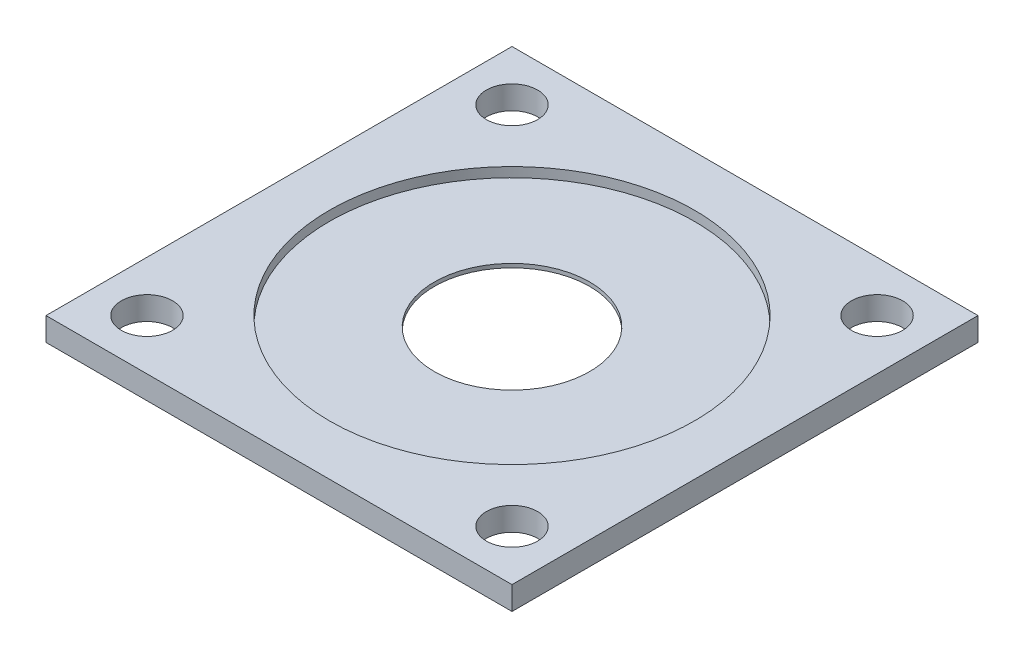
ISO-10303-21;
HEADER;
FILE_DESCRIPTION(('STEP AP214'),'2;1');
FILE_NAME('part.step','',(''),(''),'','','');
FILE_SCHEMA(('AUTOMOTIVE_DESIGN { 1 0 10303 214 1 1 1 1 }'));
ENDSEC;
DATA;
#1=APPLICATION_CONTEXT('core data for automotive mechanical design processes');
#2=APPLICATION_PROTOCOL_DEFINITION('international standard','automotive_design',2000,#1);
#3=PRODUCT_CONTEXT('',#1,'mechanical');
#4=PRODUCT('Part','Part','',(#3));
#5=PRODUCT_RELATED_PRODUCT_CATEGORY('part','',(#4));
#6=PRODUCT_DEFINITION_FORMATION('','',#4);
#7=PRODUCT_DEFINITION_CONTEXT('part definition',#1,'design');
#8=PRODUCT_DEFINITION('design','',#6,#7);
#9=PRODUCT_DEFINITION_SHAPE('','',#8);
#10=(LENGTH_UNIT() NAMED_UNIT(*) SI_UNIT(.MILLI.,.METRE.));
#11=(NAMED_UNIT(*) PLANE_ANGLE_UNIT() SI_UNIT($,.RADIAN.));
#12=(NAMED_UNIT(*) SI_UNIT($,.STERADIAN.) SOLID_ANGLE_UNIT());
#13=UNCERTAINTY_MEASURE_WITH_UNIT(LENGTH_MEASURE(1.E-05),#10,'distance_accuracy_value','');
#14=(GEOMETRIC_REPRESENTATION_CONTEXT(3) GLOBAL_UNCERTAINTY_ASSIGNED_CONTEXT((#13)) GLOBAL_UNIT_ASSIGNED_CONTEXT((#10,
#11,#12)) REPRESENTATION_CONTEXT('',''));
#15=CARTESIAN_POINT('',(0.,0.,0.));
#16=DIRECTION('',(0.,0.,1.));
#17=DIRECTION('',(1.,0.,0.));
#18=AXIS2_PLACEMENT_3D('',#15,#16,#17);
#19=CARTESIAN_POINT('',(0.,1.5,0.));
#20=DIRECTION('',(0.,-1.,0.));
#21=DIRECTION('',(0.,0.,-1.));
#22=AXIS2_PLACEMENT_3D('',#19,#20,#21);
#23=CYLINDRICAL_SURFACE('',#22,23.5);
#24=CARTESIAN_POINT('',(0.,-1.5,0.));
#25=DIRECTION('',(0.,1.,0.));
#26=DIRECTION('',(0.,0.,1.));
#27=AXIS2_PLACEMENT_3D('',#24,#25,#26);
#28=CIRCLE('',#27,23.5);
#29=CARTESIAN_POINT('',(0.,-1.5,23.5));
#30=VERTEX_POINT('',#29);
#31=EDGE_CURVE('E107',#30,#30,#28,.T.);
#32=ORIENTED_EDGE('',*,*,#31,.F.);
#33=EDGE_LOOP('',(#32));
#34=FACE_BOUND('',#33,.T.);
#35=CARTESIAN_POINT('',(0.,-0.25,0.));
#36=DIRECTION('',(0.,1.,0.));
#37=DIRECTION('',(0.,0.,1.));
#38=AXIS2_PLACEMENT_3D('',#35,#36,#37);
#39=CIRCLE('',#38,23.5);
#40=CARTESIAN_POINT('',(0.,-0.25,23.5));
#41=VERTEX_POINT('',#40);
#42=EDGE_CURVE('E181',#41,#41,#39,.T.);
#43=ORIENTED_EDGE('',*,*,#42,.T.);
#44=EDGE_LOOP('',(#43));
#45=FACE_BOUND('',#44,.T.);
#46=ADVANCED_FACE('F33',(#34,#45),#23,.F.);
#47=CARTESIAN_POINT('',(0.,1.5,30.));
#48=DIRECTION('',(0.,0.,-1.));
#49=DIRECTION('',(-1.,0.,0.));
#50=AXIS2_PLACEMENT_3D('',#47,#48,#49);
#51=PLANE('',#50);
#52=DIRECTION('',(1.,0.,0.));
#53=VECTOR('',#52,1.);
#54=CARTESIAN_POINT('',(0.,-1.5,30.));
#55=LINE('',#54,#53);
#56=CARTESIAN_POINT('',(-30.,-1.5,30.));
#57=VERTEX_POINT('',#56);
#58=CARTESIAN_POINT('',(30.,-1.5,30.));
#59=VERTEX_POINT('',#58);
#60=EDGE_CURVE('E117',#57,#59,#55,.T.);
#61=ORIENTED_EDGE('',*,*,#60,.T.);
#62=DIRECTION('',(0.,-1.,0.));
#63=VECTOR('',#62,1.);
#64=CARTESIAN_POINT('',(30.,1.5,30.));
#65=LINE('',#64,#63);
#66=CARTESIAN_POINT('',(30.,1.5,30.));
#67=VERTEX_POINT('',#66);
#68=EDGE_CURVE('E42',#67,#59,#65,.T.);
#69=ORIENTED_EDGE('',*,*,#68,.F.);
#70=DIRECTION('',(1.,0.,0.));
#71=VECTOR('',#70,1.);
#72=CARTESIAN_POINT('',(0.,1.5,30.));
#73=LINE('',#72,#71);
#74=CARTESIAN_POINT('',(-30.,1.5,30.));
#75=VERTEX_POINT('',#74);
#76=EDGE_CURVE('E85',#75,#67,#73,.T.);
#77=ORIENTED_EDGE('',*,*,#76,.F.);
#78=DIRECTION('',(0.,-1.,0.));
#79=VECTOR('',#78,1.);
#80=CARTESIAN_POINT('',(-30.,1.5,30.));
#81=LINE('',#80,#79);
#82=EDGE_CURVE('E50',#75,#57,#81,.T.);
#83=ORIENTED_EDGE('',*,*,#82,.T.);
#84=EDGE_LOOP('',(#61,#69,#77,#83));
#85=FACE_BOUND('',#84,.T.);
#86=ADVANCED_FACE('F133',(#85),#51,.F.);
#87=CARTESIAN_POINT('',(30.,1.5,0.));
#88=DIRECTION('',(-1.,0.,0.));
#89=DIRECTION('',(0.,0.,1.));
#90=AXIS2_PLACEMENT_3D('',#87,#88,#89);
#91=PLANE('',#90);
#92=DIRECTION('',(0.,0.,-1.));
#93=VECTOR('',#92,1.);
#94=CARTESIAN_POINT('',(30.,-1.5,0.));
#95=LINE('',#94,#93);
#96=CARTESIAN_POINT('',(30.,-1.5,-30.));
#97=VERTEX_POINT('',#96);
#98=EDGE_CURVE('E91',#59,#97,#95,.T.);
#99=ORIENTED_EDGE('',*,*,#98,.T.);
#100=DIRECTION('',(0.,-1.,0.));
#101=VECTOR('',#100,1.);
#102=CARTESIAN_POINT('',(30.,1.5,-30.));
#103=LINE('',#102,#101);
#104=CARTESIAN_POINT('',(30.,1.5,-30.));
#105=VERTEX_POINT('',#104);
#106=EDGE_CURVE('E89',#105,#97,#103,.T.);
#107=ORIENTED_EDGE('',*,*,#106,.F.);
#108=DIRECTION('',(0.,0.,-1.));
#109=VECTOR('',#108,1.);
#110=CARTESIAN_POINT('',(30.,1.5,0.));
#111=LINE('',#110,#109);
#112=EDGE_CURVE('E76',#67,#105,#111,.T.);
#113=ORIENTED_EDGE('',*,*,#112,.F.);
#114=ORIENTED_EDGE('',*,*,#68,.T.);
#115=EDGE_LOOP('',(#99,#107,#113,#114));
#116=FACE_BOUND('',#115,.T.);
#117=ADVANCED_FACE('F90',(#116),#91,.F.);
#118=CARTESIAN_POINT('',(0.,1.5,-30.));
#119=DIRECTION('',(0.,0.,-1.));
#120=DIRECTION('',(-1.,0.,0.));
#121=AXIS2_PLACEMENT_3D('',#118,#119,#120);
#122=PLANE('',#121);
#123=DIRECTION('',(1.,0.,0.));
#124=VECTOR('',#123,1.);
#125=CARTESIAN_POINT('',(0.,-1.5,-30.));
#126=LINE('',#125,#124);
#127=CARTESIAN_POINT('',(-30.,-1.5,-30.));
#128=VERTEX_POINT('',#127);
#129=EDGE_CURVE('E120',#128,#97,#126,.T.);
#130=ORIENTED_EDGE('',*,*,#129,.F.);
#131=DIRECTION('',(0.,-1.,0.));
#132=VECTOR('',#131,1.);
#133=CARTESIAN_POINT('',(-30.,1.5,-30.));
#134=LINE('',#133,#132);
#135=CARTESIAN_POINT('',(-30.,1.5,-30.));
#136=VERTEX_POINT('',#135);
#137=EDGE_CURVE('E64',#136,#128,#134,.T.);
#138=ORIENTED_EDGE('',*,*,#137,.F.);
#139=DIRECTION('',(1.,0.,0.));
#140=VECTOR('',#139,1.);
#141=CARTESIAN_POINT('',(0.,1.5,-30.));
#142=LINE('',#141,#140);
#143=EDGE_CURVE('E84',#136,#105,#142,.T.);
#144=ORIENTED_EDGE('',*,*,#143,.T.);
#145=ORIENTED_EDGE('',*,*,#106,.T.);
#146=EDGE_LOOP('',(#130,#138,#144,#145));
#147=FACE_BOUND('',#146,.T.);
#148=ADVANCED_FACE('F95',(#147),#122,.T.);
#149=CARTESIAN_POINT('',(23.5,1.5,23.5));
#150=DIRECTION('',(0.,-1.,0.));
#151=DIRECTION('',(0.,0.,-1.));
#152=AXIS2_PLACEMENT_3D('',#149,#150,#151);
#153=CYLINDRICAL_SURFACE('',#152,3.3);
#154=CARTESIAN_POINT('',(23.5,1.5,23.5));
#155=DIRECTION('',(0.,1.,0.));
#156=DIRECTION('',(0.,0.,1.));
#157=AXIS2_PLACEMENT_3D('',#154,#155,#156);
#158=CIRCLE('',#157,3.3);
#159=CARTESIAN_POINT('',(23.5,1.5,26.8));
#160=VERTEX_POINT('',#159);
#161=EDGE_CURVE('E98',#160,#160,#158,.T.);
#162=ORIENTED_EDGE('',*,*,#161,.T.);
#163=EDGE_LOOP('',(#162));
#164=FACE_BOUND('',#163,.T.);
#165=CARTESIAN_POINT('',(23.5,-1.5,23.5));
#166=DIRECTION('',(0.,1.,0.));
#167=DIRECTION('',(0.,0.,1.));
#168=AXIS2_PLACEMENT_3D('',#165,#166,#167);
#169=CIRCLE('',#168,3.3);
#170=CARTESIAN_POINT('',(23.5,-1.5,26.8));
#171=VERTEX_POINT('',#170);
#172=EDGE_CURVE('E125',#171,#171,#169,.T.);
#173=ORIENTED_EDGE('',*,*,#172,.F.);
#174=EDGE_LOOP('',(#173));
#175=FACE_BOUND('',#174,.T.);
#176=ADVANCED_FACE('F140',(#164,#175),#153,.F.);
#177=CARTESIAN_POINT('',(-30.,1.5,0.));
#178=DIRECTION('',(-1.,0.,0.));
#179=DIRECTION('',(0.,0.,1.));
#180=AXIS2_PLACEMENT_3D('',#177,#178,#179);
#181=PLANE('',#180);
#182=DIRECTION('',(0.,0.,-1.));
#183=VECTOR('',#182,1.);
#184=CARTESIAN_POINT('',(-30.,-1.5,0.));
#185=LINE('',#184,#183);
#186=EDGE_CURVE('E122',#57,#128,#185,.T.);
#187=ORIENTED_EDGE('',*,*,#186,.F.);
#188=ORIENTED_EDGE('',*,*,#82,.F.);
#189=DIRECTION('',(0.,0.,-1.));
#190=VECTOR('',#189,1.);
#191=CARTESIAN_POINT('',(-30.,1.5,0.));
#192=LINE('',#191,#190);
#193=EDGE_CURVE('E96',#75,#136,#192,.T.);
#194=ORIENTED_EDGE('',*,*,#193,.T.);
#195=ORIENTED_EDGE('',*,*,#137,.T.);
#196=EDGE_LOOP('',(#187,#188,#194,#195));
#197=FACE_BOUND('',#196,.T.);
#198=ADVANCED_FACE('F137',(#197),#181,.T.);
#199=CARTESIAN_POINT('',(-23.5,1.5,-23.5));
#200=DIRECTION('',(0.,-1.,0.));
#201=DIRECTION('',(0.,0.,-1.));
#202=AXIS2_PLACEMENT_3D('',#199,#200,#201);
#203=CYLINDRICAL_SURFACE('',#202,3.3);
#204=CARTESIAN_POINT('',(-23.5,1.5,-23.5));
#205=DIRECTION('',(0.,1.,0.));
#206=DIRECTION('',(0.,0.,1.));
#207=AXIS2_PLACEMENT_3D('',#204,#205,#206);
#208=CIRCLE('',#207,3.3);
#209=CARTESIAN_POINT('',(-23.5,1.5,-20.2));
#210=VERTEX_POINT('',#209);
#211=EDGE_CURVE('E178',#210,#210,#208,.T.);
#212=ORIENTED_EDGE('',*,*,#211,.T.);
#213=EDGE_LOOP('',(#212));
#214=FACE_BOUND('',#213,.T.);
#215=CARTESIAN_POINT('',(-23.5,-1.5,-23.5));
#216=DIRECTION('',(0.,1.,0.));
#217=DIRECTION('',(0.,0.,1.));
#218=AXIS2_PLACEMENT_3D('',#215,#216,#217);
#219=CIRCLE('',#218,3.3);
#220=CARTESIAN_POINT('',(-23.5,-1.5,-20.2));
#221=VERTEX_POINT('',#220);
#222=EDGE_CURVE('E114',#221,#221,#219,.T.);
#223=ORIENTED_EDGE('',*,*,#222,.F.);
#224=EDGE_LOOP('',(#223));
#225=FACE_BOUND('',#224,.T.);
#226=ADVANCED_FACE('F139',(#214,#225),#203,.F.);
#227=CARTESIAN_POINT('',(23.5,1.5,-23.5));
#228=DIRECTION('',(0.,-1.,0.));
#229=DIRECTION('',(0.,0.,-1.));
#230=AXIS2_PLACEMENT_3D('',#227,#228,#229);
#231=CYLINDRICAL_SURFACE('',#230,3.3);
#232=CARTESIAN_POINT('',(23.5,1.5,-23.5));
#233=DIRECTION('',(0.,1.,0.));
#234=DIRECTION('',(0.,0.,1.));
#235=AXIS2_PLACEMENT_3D('',#232,#233,#234);
#236=CIRCLE('',#235,3.3);
#237=CARTESIAN_POINT('',(23.5,1.5,-20.2));
#238=VERTEX_POINT('',#237);
#239=EDGE_CURVE('E175',#238,#238,#236,.F.);
#240=ORIENTED_EDGE('',*,*,#239,.F.);
#241=EDGE_LOOP('',(#240));
#242=FACE_BOUND('',#241,.T.);
#243=CARTESIAN_POINT('',(23.5,-1.5,-23.5));
#244=DIRECTION('',(0.,1.,0.));
#245=DIRECTION('',(0.,0.,1.));
#246=AXIS2_PLACEMENT_3D('',#243,#244,#245);
#247=CIRCLE('',#246,3.3);
#248=CARTESIAN_POINT('',(23.5,-1.5,-20.2));
#249=VERTEX_POINT('',#248);
#250=EDGE_CURVE('E110',#249,#249,#247,.F.);
#251=ORIENTED_EDGE('',*,*,#250,.T.);
#252=EDGE_LOOP('',(#251));
#253=FACE_BOUND('',#252,.T.);
#254=ADVANCED_FACE('F146',(#242,#253),#231,.F.);
#255=CARTESIAN_POINT('',(0.,0.25,0.));
#256=DIRECTION('',(0.,1.,0.));
#257=DIRECTION('',(0.,0.,1.));
#258=AXIS2_PLACEMENT_3D('',#255,#256,#257);
#259=CIRCLE('',#258,23.5);
#260=CARTESIAN_POINT('',(0.,0.25,23.5));
#261=VERTEX_POINT('',#260);
#262=EDGE_CURVE('E11',#261,#261,#259,.T.);
#263=ORIENTED_EDGE('',*,*,#262,.F.);
#264=EDGE_LOOP('',(#263));
#265=FACE_BOUND('',#264,.T.);
#266=CARTESIAN_POINT('',(0.,1.5,0.));
#267=DIRECTION('',(0.,1.,0.));
#268=DIRECTION('',(0.,0.,1.));
#269=AXIS2_PLACEMENT_3D('',#266,#267,#268);
#270=CIRCLE('',#269,23.5);
#271=CARTESIAN_POINT('',(0.,1.5,23.5));
#272=VERTEX_POINT('',#271);
#273=EDGE_CURVE('E131',#272,#272,#270,.T.);
#274=ORIENTED_EDGE('',*,*,#273,.T.);
#275=EDGE_LOOP('',(#274));
#276=FACE_BOUND('',#275,.T.);
#277=ADVANCED_FACE('F35',(#265,#276),#23,.F.);
#278=CARTESIAN_POINT('',(-23.5,1.5,23.5));
#279=DIRECTION('',(0.,-1.,0.));
#280=DIRECTION('',(0.,0.,-1.));
#281=AXIS2_PLACEMENT_3D('',#278,#279,#280);
#282=CYLINDRICAL_SURFACE('',#281,3.3);
#283=CARTESIAN_POINT('',(-23.5,1.5,23.5));
#284=DIRECTION('',(0.,1.,0.));
#285=DIRECTION('',(0.,0.,1.));
#286=AXIS2_PLACEMENT_3D('',#283,#284,#285);
#287=CIRCLE('',#286,3.3);
#288=CARTESIAN_POINT('',(-23.5,1.5,26.8));
#289=VERTEX_POINT('',#288);
#290=EDGE_CURVE('E104',#289,#289,#287,.F.);
#291=ORIENTED_EDGE('',*,*,#290,.F.);
#292=EDGE_LOOP('',(#291));
#293=FACE_BOUND('',#292,.T.);
#294=CARTESIAN_POINT('',(-23.5,-1.5,23.5));
#295=DIRECTION('',(0.,1.,0.));
#296=DIRECTION('',(0.,0.,1.));
#297=AXIS2_PLACEMENT_3D('',#294,#295,#296);
#298=CIRCLE('',#297,3.3);
#299=CARTESIAN_POINT('',(-23.5,-1.5,26.8));
#300=VERTEX_POINT('',#299);
#301=EDGE_CURVE('E128',#300,#300,#298,.F.);
#302=ORIENTED_EDGE('',*,*,#301,.T.);
#303=EDGE_LOOP('',(#302));
#304=FACE_BOUND('',#303,.T.);
#305=ADVANCED_FACE('F161',(#293,#304),#282,.F.);
#306=CARTESIAN_POINT('',(0.,1.5,0.));
#307=DIRECTION('',(0.,1.,0.));
#308=DIRECTION('',(0.,0.,1.));
#309=AXIS2_PLACEMENT_3D('',#306,#307,#308);
#310=PLANE('',#309);
#311=ORIENTED_EDGE('',*,*,#273,.F.);
#312=EDGE_LOOP('',(#311));
#313=FACE_BOUND('',#312,.T.);
#314=ORIENTED_EDGE('',*,*,#239,.T.);
#315=EDGE_LOOP('',(#314));
#316=FACE_BOUND('',#315,.T.);
#317=ORIENTED_EDGE('',*,*,#211,.F.);
#318=EDGE_LOOP('',(#317));
#319=FACE_BOUND('',#318,.T.);
#320=ORIENTED_EDGE('',*,*,#76,.T.);
#321=ORIENTED_EDGE('',*,*,#112,.T.);
#322=ORIENTED_EDGE('',*,*,#143,.F.);
#323=ORIENTED_EDGE('',*,*,#193,.F.);
#324=EDGE_LOOP('',(#320,#321,#322,#323));
#325=FACE_BOUND('',#324,.T.);
#326=ORIENTED_EDGE('',*,*,#161,.F.);
#327=EDGE_LOOP('',(#326));
#328=FACE_BOUND('',#327,.T.);
#329=ORIENTED_EDGE('',*,*,#290,.T.);
#330=EDGE_LOOP('',(#329));
#331=FACE_BOUND('',#330,.T.);
#332=ADVANCED_FACE('F80',(#313,#316,#319,#325,#328,#331),#310,.T.);
#333=CARTESIAN_POINT('',(0.,-1.5,0.));
#334=DIRECTION('',(0.,1.,0.));
#335=DIRECTION('',(0.,0.,1.));
#336=AXIS2_PLACEMENT_3D('',#333,#334,#335);
#337=PLANE('',#336);
#338=ORIENTED_EDGE('',*,*,#31,.T.);
#339=EDGE_LOOP('',(#338));
#340=FACE_BOUND('',#339,.T.);
#341=ORIENTED_EDGE('',*,*,#250,.F.);
#342=EDGE_LOOP('',(#341));
#343=FACE_BOUND('',#342,.T.);
#344=ORIENTED_EDGE('',*,*,#222,.T.);
#345=EDGE_LOOP('',(#344));
#346=FACE_BOUND('',#345,.T.);
#347=ORIENTED_EDGE('',*,*,#60,.F.);
#348=ORIENTED_EDGE('',*,*,#186,.T.);
#349=ORIENTED_EDGE('',*,*,#129,.T.);
#350=ORIENTED_EDGE('',*,*,#98,.F.);
#351=EDGE_LOOP('',(#347,#348,#349,#350));
#352=FACE_BOUND('',#351,.T.);
#353=ORIENTED_EDGE('',*,*,#172,.T.);
#354=EDGE_LOOP('',(#353));
#355=FACE_BOUND('',#354,.T.);
#356=ORIENTED_EDGE('',*,*,#301,.F.);
#357=EDGE_LOOP('',(#356));
#358=FACE_BOUND('',#357,.T.);
#359=ADVANCED_FACE('F135',(#340,#343,#346,#352,#355,#358),#337,.F.);
#360=CARTESIAN_POINT('',(0.,0.25,0.));
#361=DIRECTION('',(0.,-1.,0.));
#362=DIRECTION('',(0.,0.,-1.));
#363=AXIS2_PLACEMENT_3D('',#360,#361,#362);
#364=CYLINDRICAL_SURFACE('',#363,10.);
#365=CARTESIAN_POINT('',(0.,0.25,0.));
#366=DIRECTION('',(0.,1.,0.));
#367=DIRECTION('',(0.,0.,1.));
#368=AXIS2_PLACEMENT_3D('',#365,#366,#367);
#369=CIRCLE('',#368,10.);
#370=CARTESIAN_POINT('',(0.,0.25,10.));
#371=VERTEX_POINT('',#370);
#372=EDGE_CURVE('E111',#371,#371,#369,.T.);
#373=ORIENTED_EDGE('',*,*,#372,.T.);
#374=EDGE_LOOP('',(#373));
#375=FACE_BOUND('',#374,.T.);
#376=CARTESIAN_POINT('',(0.,-0.25,0.));
#377=DIRECTION('',(0.,1.,0.));
#378=DIRECTION('',(0.,0.,1.));
#379=AXIS2_PLACEMENT_3D('',#376,#377,#378);
#380=CIRCLE('',#379,10.);
#381=CARTESIAN_POINT('',(0.,-0.25,10.));
#382=VERTEX_POINT('',#381);
#383=EDGE_CURVE('E215',#382,#382,#380,.T.);
#384=ORIENTED_EDGE('',*,*,#383,.F.);
#385=EDGE_LOOP('',(#384));
#386=FACE_BOUND('',#385,.T.);
#387=ADVANCED_FACE('F193',(#375,#386),#364,.F.);
#388=CARTESIAN_POINT('',(0.,0.25,0.));
#389=DIRECTION('',(0.,1.,0.));
#390=DIRECTION('',(0.,0.,1.));
#391=AXIS2_PLACEMENT_3D('',#388,#389,#390);
#392=PLANE('',#391);
#393=ORIENTED_EDGE('',*,*,#372,.F.);
#394=EDGE_LOOP('',(#393));
#395=FACE_BOUND('',#394,.T.);
#396=ORIENTED_EDGE('',*,*,#262,.T.);
#397=EDGE_LOOP('',(#396));
#398=FACE_BOUND('',#397,.T.);
#399=ADVANCED_FACE('F200',(#395,#398),#392,.T.);
#400=CARTESIAN_POINT('',(0.,-0.25,0.));
#401=DIRECTION('',(0.,1.,0.));
#402=DIRECTION('',(0.,0.,1.));
#403=AXIS2_PLACEMENT_3D('',#400,#401,#402);
#404=PLANE('',#403);
#405=ORIENTED_EDGE('',*,*,#383,.T.);
#406=EDGE_LOOP('',(#405));
#407=FACE_BOUND('',#406,.T.);
#408=ORIENTED_EDGE('',*,*,#42,.F.);
#409=EDGE_LOOP('',(#408));
#410=FACE_BOUND('',#409,.T.);
#411=ADVANCED_FACE('F202',(#407,#410),#404,.F.);
#412=CLOSED_SHELL('',(#46,#86,#117,#148,#176,#198,#226,#254,#277,#305,#332,#359,#387,#399,#411));
#413=MANIFOLD_SOLID_BREP('B2',#412);
#414=ADVANCED_BREP_SHAPE_REPRESENTATION('',(#18,#413),#14);
#415=SHAPE_DEFINITION_REPRESENTATION(#9,#414);
ENDSEC;
END-ISO-10303-21;
